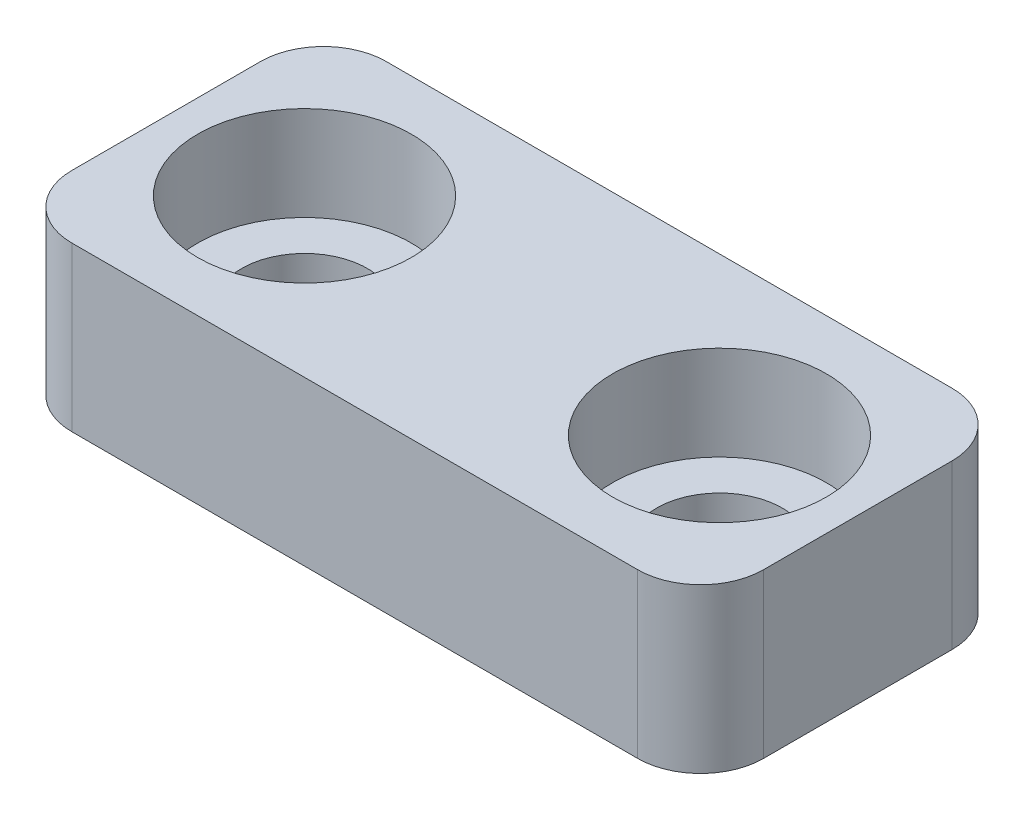
ISO-10303-21;
HEADER;
FILE_DESCRIPTION(('STEP AP214'),'2;1');
FILE_NAME('part.step','',(''),(''),'','','');
FILE_SCHEMA(('AUTOMOTIVE_DESIGN { 1 0 10303 214 1 1 1 1 }'));
ENDSEC;
DATA;
#1=APPLICATION_CONTEXT('core data for automotive mechanical design processes');
#2=APPLICATION_PROTOCOL_DEFINITION('international standard','automotive_design',2000,#1);
#3=PRODUCT_CONTEXT('',#1,'mechanical');
#4=PRODUCT('Part','Part','',(#3));
#5=PRODUCT_RELATED_PRODUCT_CATEGORY('part','',(#4));
#6=PRODUCT_DEFINITION_FORMATION('','',#4);
#7=PRODUCT_DEFINITION_CONTEXT('part definition',#1,'design');
#8=PRODUCT_DEFINITION('design','',#6,#7);
#9=PRODUCT_DEFINITION_SHAPE('','',#8);
#10=(LENGTH_UNIT() NAMED_UNIT(*) SI_UNIT(.MILLI.,.METRE.));
#11=(NAMED_UNIT(*) PLANE_ANGLE_UNIT() SI_UNIT($,.RADIAN.));
#12=(NAMED_UNIT(*) SI_UNIT($,.STERADIAN.) SOLID_ANGLE_UNIT());
#13=UNCERTAINTY_MEASURE_WITH_UNIT(LENGTH_MEASURE(1.E-05),#10,'distance_accuracy_value','');
#14=(GEOMETRIC_REPRESENTATION_CONTEXT(3) GLOBAL_UNCERTAINTY_ASSIGNED_CONTEXT((#13)) GLOBAL_UNIT_ASSIGNED_CONTEXT((#10,
#11,#12)) REPRESENTATION_CONTEXT('',''));
#15=CARTESIAN_POINT('',(0.,0.,0.));
#16=DIRECTION('',(0.,0.,1.));
#17=DIRECTION('',(1.,0.,0.));
#18=AXIS2_PLACEMENT_3D('',#15,#16,#17);
#19=CARTESIAN_POINT('',(3.30000000000001,2.6,0.));
#20=DIRECTION('',(0.,-1.,0.));
#21=DIRECTION('',(0.,0.,-1.));
#22=AXIS2_PLACEMENT_3D('',#19,#20,#21);
#23=CYLINDRICAL_SURFACE('',#22,0.999999999999999);
#24=CARTESIAN_POINT('',(3.30000000000001,0.,0.));
#25=DIRECTION('',(0.,1.,0.));
#26=DIRECTION('',(0.,0.,1.));
#27=AXIS2_PLACEMENT_3D('',#24,#25,#26);
#28=CIRCLE('',#27,0.999999999999999);
#29=CARTESIAN_POINT('',(3.30000000000001,0.,0.999999999999999));
#30=VERTEX_POINT('',#29);
#31=EDGE_CURVE('E135',#30,#30,#28,.T.);
#32=ORIENTED_EDGE('',*,*,#31,.F.);
#33=EDGE_LOOP('',(#32));
#34=FACE_BOUND('',#33,.T.);
#35=CARTESIAN_POINT('',(3.30000000000001,1.1,0.));
#36=DIRECTION('',(0.,1.,0.));
#37=DIRECTION('',(0.,0.,1.));
#38=AXIS2_PLACEMENT_3D('',#35,#36,#37);
#39=CIRCLE('',#38,0.999999999999999);
#40=CARTESIAN_POINT('',(3.30000000000001,1.1,0.999999999999999));
#41=VERTEX_POINT('',#40);
#42=EDGE_CURVE('E148',#41,#41,#39,.T.);
#43=ORIENTED_EDGE('',*,*,#42,.T.);
#44=EDGE_LOOP('',(#43));
#45=FACE_BOUND('',#44,.T.);
#46=ADVANCED_FACE('F35',(#34,#45),#23,.F.);
#47=CARTESIAN_POINT('',(-3.29999999999999,2.6,0.));
#48=DIRECTION('',(0.,-1.,0.));
#49=DIRECTION('',(0.,0.,-1.));
#50=AXIS2_PLACEMENT_3D('',#47,#48,#49);
#51=CYLINDRICAL_SURFACE('',#50,1.);
#52=CARTESIAN_POINT('',(-3.29999999999999,0.,0.));
#53=DIRECTION('',(0.,1.,0.));
#54=DIRECTION('',(0.,0.,1.));
#55=AXIS2_PLACEMENT_3D('',#52,#53,#54);
#56=CIRCLE('',#55,1.);
#57=CARTESIAN_POINT('',(-3.29999999999999,0.,1.));
#58=VERTEX_POINT('',#57);
#59=EDGE_CURVE('E129',#58,#58,#56,.T.);
#60=ORIENTED_EDGE('',*,*,#59,.F.);
#61=EDGE_LOOP('',(#60));
#62=FACE_BOUND('',#61,.T.);
#63=CARTESIAN_POINT('',(-3.29999999999999,1.1,0.));
#64=DIRECTION('',(0.,1.,0.));
#65=DIRECTION('',(0.,0.,1.));
#66=AXIS2_PLACEMENT_3D('',#63,#64,#65);
#67=CIRCLE('',#66,1.);
#68=CARTESIAN_POINT('',(-3.29999999999999,1.1,1.));
#69=VERTEX_POINT('',#68);
#70=EDGE_CURVE('E144',#69,#69,#67,.T.);
#71=ORIENTED_EDGE('',*,*,#70,.T.);
#72=EDGE_LOOP('',(#71));
#73=FACE_BOUND('',#72,.T.);
#74=ADVANCED_FACE('F215',(#62,#73),#51,.F.);
#75=CARTESIAN_POINT('',(0.,2.6,0.));
#76=DIRECTION('',(0.,-1.,0.));
#77=DIRECTION('',(0.,0.,-1.));
#78=AXIS2_PLACEMENT_3D('',#75,#76,#77);
#79=PLANE('',#78);
#80=CARTESIAN_POINT('',(3.30000000000001,2.6,0.));
#81=DIRECTION('',(0.,1.,0.));
#82=DIRECTION('',(0.,0.,1.));
#83=AXIS2_PLACEMENT_3D('',#80,#81,#82);
#84=CIRCLE('',#83,1.7);
#85=CARTESIAN_POINT('',(3.30000000000001,2.6,1.7));
#86=VERTEX_POINT('',#85);
#87=EDGE_CURVE('E197',#86,#86,#84,.T.);
#88=ORIENTED_EDGE('',*,*,#87,.F.);
#89=EDGE_LOOP('',(#88));
#90=FACE_BOUND('',#89,.T.);
#91=CARTESIAN_POINT('',(-3.29999999999999,2.6,0.));
#92=DIRECTION('',(0.,1.,0.));
#93=DIRECTION('',(0.,0.,1.));
#94=AXIS2_PLACEMENT_3D('',#91,#92,#93);
#95=CIRCLE('',#94,1.7);
#96=CARTESIAN_POINT('',(-3.29999999999999,2.6,1.7));
#97=VERTEX_POINT('',#96);
#98=EDGE_CURVE('E151',#97,#97,#95,.T.);
#99=ORIENTED_EDGE('',*,*,#98,.F.);
#100=EDGE_LOOP('',(#99));
#101=FACE_BOUND('',#100,.T.);
#102=DIRECTION('',(1.,0.,0.));
#103=VECTOR('',#102,1.);
#104=CARTESIAN_POINT('',(-5.49999999999999,2.6,2.50000000000001));
#105=LINE('',#104,#103);
#106=CARTESIAN_POINT('',(-4.49999999999999,2.6,2.50000000000001));
#107=VERTEX_POINT('',#106);
#108=CARTESIAN_POINT('',(4.50000000000001,2.6,2.50000000000001));
#109=VERTEX_POINT('',#108);
#110=EDGE_CURVE('E138',#107,#109,#105,.T.);
#111=ORIENTED_EDGE('',*,*,#110,.T.);
#112=CARTESIAN_POINT('',(4.50000000000001,2.6,1.50000000000001));
#113=DIRECTION('',(0.,-1.,0.));
#114=DIRECTION('',(0.,0.,-1.));
#115=AXIS2_PLACEMENT_3D('',#112,#113,#114);
#116=CIRCLE('',#115,1.);
#117=CARTESIAN_POINT('',(5.50000000000001,2.6,1.50000000000001));
#118=VERTEX_POINT('',#117);
#119=EDGE_CURVE('E166',#109,#118,#116,.F.);
#120=ORIENTED_EDGE('',*,*,#119,.T.);
#121=DIRECTION('',(0.,0.,-1.));
#122=VECTOR('',#121,1.);
#123=CARTESIAN_POINT('',(5.50000000000001,2.6,2.50000000000001));
#124=LINE('',#123,#122);
#125=CARTESIAN_POINT('',(5.50000000000001,2.6,-1.5));
#126=VERTEX_POINT('',#125);
#127=EDGE_CURVE('E121',#118,#126,#124,.T.);
#128=ORIENTED_EDGE('',*,*,#127,.T.);
#129=CARTESIAN_POINT('',(4.50000000000001,2.6,-1.5));
#130=DIRECTION('',(0.,-1.,0.));
#131=DIRECTION('',(0.,0.,-1.));
#132=AXIS2_PLACEMENT_3D('',#129,#130,#131);
#133=CIRCLE('',#132,1.);
#134=CARTESIAN_POINT('',(4.50000000000001,2.6,-2.5));
#135=VERTEX_POINT('',#134);
#136=EDGE_CURVE('E164',#126,#135,#133,.F.);
#137=ORIENTED_EDGE('',*,*,#136,.T.);
#138=DIRECTION('',(-1.,0.,0.));
#139=VECTOR('',#138,1.);
#140=CARTESIAN_POINT('',(-5.49999999999999,2.6,-2.5));
#141=LINE('',#140,#139);
#142=CARTESIAN_POINT('',(-4.49999999999999,2.6,-2.5));
#143=VERTEX_POINT('',#142);
#144=EDGE_CURVE('E177',#135,#143,#141,.T.);
#145=ORIENTED_EDGE('',*,*,#144,.T.);
#146=CARTESIAN_POINT('',(-4.49999999999999,2.6,-1.5));
#147=DIRECTION('',(0.,-1.,0.));
#148=DIRECTION('',(0.,0.,-1.));
#149=AXIS2_PLACEMENT_3D('',#146,#147,#148);
#150=CIRCLE('',#149,1.);
#151=CARTESIAN_POINT('',(-5.49999999999999,2.6,-1.5));
#152=VERTEX_POINT('',#151);
#153=EDGE_CURVE('E56',#143,#152,#150,.F.);
#154=ORIENTED_EDGE('',*,*,#153,.T.);
#155=DIRECTION('',(0.,0.,1.));
#156=VECTOR('',#155,1.);
#157=CARTESIAN_POINT('',(-5.49999999999999,2.6,2.50000000000001));
#158=LINE('',#157,#156);
#159=CARTESIAN_POINT('',(-5.49999999999999,2.6,1.50000000000001));
#160=VERTEX_POINT('',#159);
#161=EDGE_CURVE('E185',#152,#160,#158,.T.);
#162=ORIENTED_EDGE('',*,*,#161,.T.);
#163=CARTESIAN_POINT('',(-4.49999999999999,2.6,1.50000000000001));
#164=DIRECTION('',(0.,-1.,0.));
#165=DIRECTION('',(0.,0.,-1.));
#166=AXIS2_PLACEMENT_3D('',#163,#164,#165);
#167=CIRCLE('',#166,1.);
#168=EDGE_CURVE('E161',#160,#107,#167,.F.);
#169=ORIENTED_EDGE('',*,*,#168,.T.);
#170=EDGE_LOOP('',(#111,#120,#128,#137,#145,#154,#162,#169));
#171=FACE_BOUND('',#170,.T.);
#172=ADVANCED_FACE('F212',(#90,#101,#171),#79,.F.);
#173=CARTESIAN_POINT('',(0.,0.,0.));
#174=DIRECTION('',(0.,-1.,0.));
#175=DIRECTION('',(0.,0.,-1.));
#176=AXIS2_PLACEMENT_3D('',#173,#174,#175);
#177=PLANE('',#176);
#178=ORIENTED_EDGE('',*,*,#59,.T.);
#179=EDGE_LOOP('',(#178));
#180=FACE_BOUND('',#179,.T.);
#181=DIRECTION('',(0.,0.,-1.));
#182=VECTOR('',#181,1.);
#183=CARTESIAN_POINT('',(5.50000000000001,0.,2.50000000000001));
#184=LINE('',#183,#182);
#185=CARTESIAN_POINT('',(5.50000000000001,0.,1.50000000000001));
#186=VERTEX_POINT('',#185);
#187=CARTESIAN_POINT('',(5.50000000000001,0.,-1.5));
#188=VERTEX_POINT('',#187);
#189=EDGE_CURVE('E118',#186,#188,#184,.T.);
#190=ORIENTED_EDGE('',*,*,#189,.F.);
#191=CARTESIAN_POINT('',(4.50000000000001,0.,1.50000000000001));
#192=DIRECTION('',(0.,-1.,0.));
#193=DIRECTION('',(0.,0.,-1.));
#194=AXIS2_PLACEMENT_3D('',#191,#192,#193);
#195=CIRCLE('',#194,1.);
#196=CARTESIAN_POINT('',(4.50000000000001,0.,2.50000000000001));
#197=VERTEX_POINT('',#196);
#198=EDGE_CURVE('E101',#186,#197,#195,.T.);
#199=ORIENTED_EDGE('',*,*,#198,.T.);
#200=DIRECTION('',(1.,0.,0.));
#201=VECTOR('',#200,1.);
#202=CARTESIAN_POINT('',(-5.49999999999999,0.,2.50000000000001));
#203=LINE('',#202,#201);
#204=CARTESIAN_POINT('',(-4.49999999999999,0.,2.50000000000001));
#205=VERTEX_POINT('',#204);
#206=EDGE_CURVE('E142',#205,#197,#203,.T.);
#207=ORIENTED_EDGE('',*,*,#206,.F.);
#208=CARTESIAN_POINT('',(-4.49999999999999,0.,1.50000000000001));
#209=DIRECTION('',(0.,-1.,0.));
#210=DIRECTION('',(0.,0.,-1.));
#211=AXIS2_PLACEMENT_3D('',#208,#209,#210);
#212=CIRCLE('',#211,1.);
#213=CARTESIAN_POINT('',(-5.49999999999999,0.,1.50000000000001));
#214=VERTEX_POINT('',#213);
#215=EDGE_CURVE('E122',#205,#214,#212,.T.);
#216=ORIENTED_EDGE('',*,*,#215,.T.);
#217=DIRECTION('',(0.,0.,1.));
#218=VECTOR('',#217,1.);
#219=CARTESIAN_POINT('',(-5.49999999999999,0.,2.50000000000001));
#220=LINE('',#219,#218);
#221=CARTESIAN_POINT('',(-5.49999999999999,0.,-1.5));
#222=VERTEX_POINT('',#221);
#223=EDGE_CURVE('E132',#222,#214,#220,.T.);
#224=ORIENTED_EDGE('',*,*,#223,.F.);
#225=CARTESIAN_POINT('',(-4.49999999999999,0.,-1.5));
#226=DIRECTION('',(0.,-1.,0.));
#227=DIRECTION('',(0.,0.,-1.));
#228=AXIS2_PLACEMENT_3D('',#225,#226,#227);
#229=CIRCLE('',#228,1.);
#230=CARTESIAN_POINT('',(-4.49999999999999,0.,-2.5));
#231=VERTEX_POINT('',#230);
#232=EDGE_CURVE('E155',#222,#231,#229,.T.);
#233=ORIENTED_EDGE('',*,*,#232,.T.);
#234=DIRECTION('',(-1.,0.,0.));
#235=VECTOR('',#234,1.);
#236=CARTESIAN_POINT('',(-5.49999999999999,0.,-2.5));
#237=LINE('',#236,#235);
#238=CARTESIAN_POINT('',(4.50000000000001,0.,-2.5));
#239=VERTEX_POINT('',#238);
#240=EDGE_CURVE('E128',#239,#231,#237,.T.);
#241=ORIENTED_EDGE('',*,*,#240,.F.);
#242=CARTESIAN_POINT('',(4.50000000000001,0.,-1.5));
#243=DIRECTION('',(0.,-1.,0.));
#244=DIRECTION('',(0.,0.,-1.));
#245=AXIS2_PLACEMENT_3D('',#242,#243,#244);
#246=CIRCLE('',#245,1.);
#247=EDGE_CURVE('E112',#239,#188,#246,.T.);
#248=ORIENTED_EDGE('',*,*,#247,.T.);
#249=EDGE_LOOP('',(#190,#199,#207,#216,#224,#233,#241,#248));
#250=FACE_BOUND('',#249,.T.);
#251=ORIENTED_EDGE('',*,*,#31,.T.);
#252=EDGE_LOOP('',(#251));
#253=FACE_BOUND('',#252,.T.);
#254=ADVANCED_FACE('F125',(#180,#250,#253),#177,.T.);
#255=CARTESIAN_POINT('',(5.50000000000001,2.6,2.50000000000001));
#256=DIRECTION('',(-1.,0.,0.));
#257=DIRECTION('',(0.,0.,1.));
#258=AXIS2_PLACEMENT_3D('',#255,#256,#257);
#259=PLANE('',#258);
#260=ORIENTED_EDGE('',*,*,#127,.F.);
#261=DIRECTION('',(0.,-1.,0.));
#262=VECTOR('',#261,1.);
#263=CARTESIAN_POINT('',(5.50000000000001,2.6,1.50000000000001));
#264=LINE('',#263,#262);
#265=EDGE_CURVE('E105',#118,#186,#264,.T.);
#266=ORIENTED_EDGE('',*,*,#265,.T.);
#267=ORIENTED_EDGE('',*,*,#189,.T.);
#268=DIRECTION('',(0.,-1.,0.));
#269=VECTOR('',#268,1.);
#270=CARTESIAN_POINT('',(5.50000000000001,2.6,-1.5));
#271=LINE('',#270,#269);
#272=EDGE_CURVE('E123',#188,#126,#271,.F.);
#273=ORIENTED_EDGE('',*,*,#272,.T.);
#274=EDGE_LOOP('',(#260,#266,#267,#273));
#275=FACE_BOUND('',#274,.T.);
#276=ADVANCED_FACE('F117',(#275),#259,.F.);
#277=CARTESIAN_POINT('',(-5.49999999999999,2.6,-2.5));
#278=DIRECTION('',(0.,0.,1.));
#279=DIRECTION('',(1.,0.,0.));
#280=AXIS2_PLACEMENT_3D('',#277,#278,#279);
#281=PLANE('',#280);
#282=ORIENTED_EDGE('',*,*,#144,.F.);
#283=DIRECTION('',(0.,-1.,0.));
#284=VECTOR('',#283,1.);
#285=CARTESIAN_POINT('',(4.50000000000001,2.6,-2.5));
#286=LINE('',#285,#284);
#287=EDGE_CURVE('E170',#135,#239,#286,.T.);
#288=ORIENTED_EDGE('',*,*,#287,.T.);
#289=ORIENTED_EDGE('',*,*,#240,.T.);
#290=DIRECTION('',(0.,-1.,0.));
#291=VECTOR('',#290,1.);
#292=CARTESIAN_POINT('',(-4.49999999999999,2.6,-2.5));
#293=LINE('',#292,#291);
#294=EDGE_CURVE('E168',#231,#143,#293,.F.);
#295=ORIENTED_EDGE('',*,*,#294,.T.);
#296=EDGE_LOOP('',(#282,#288,#289,#295));
#297=FACE_BOUND('',#296,.T.);
#298=ADVANCED_FACE('F175',(#297),#281,.F.);
#299=CARTESIAN_POINT('',(-5.49999999999999,2.6,2.50000000000001));
#300=DIRECTION('',(1.,0.,0.));
#301=DIRECTION('',(0.,0.,-1.));
#302=AXIS2_PLACEMENT_3D('',#299,#300,#301);
#303=PLANE('',#302);
#304=ORIENTED_EDGE('',*,*,#161,.F.);
#305=DIRECTION('',(0.,-1.,0.));
#306=VECTOR('',#305,1.);
#307=CARTESIAN_POINT('',(-5.49999999999999,2.6,-1.5));
#308=LINE('',#307,#306);
#309=EDGE_CURVE('E11',#152,#222,#308,.T.);
#310=ORIENTED_EDGE('',*,*,#309,.T.);
#311=ORIENTED_EDGE('',*,*,#223,.T.);
#312=DIRECTION('',(0.,-1.,0.));
#313=VECTOR('',#312,1.);
#314=CARTESIAN_POINT('',(-5.49999999999999,2.6,1.50000000000001));
#315=LINE('',#314,#313);
#316=EDGE_CURVE('E43',#214,#160,#315,.F.);
#317=ORIENTED_EDGE('',*,*,#316,.T.);
#318=EDGE_LOOP('',(#304,#310,#311,#317));
#319=FACE_BOUND('',#318,.T.);
#320=ADVANCED_FACE('F184',(#319),#303,.F.);
#321=CARTESIAN_POINT('',(-5.49999999999999,2.6,2.50000000000001));
#322=DIRECTION('',(0.,0.,-1.));
#323=DIRECTION('',(-1.,0.,0.));
#324=AXIS2_PLACEMENT_3D('',#321,#322,#323);
#325=PLANE('',#324);
#326=ORIENTED_EDGE('',*,*,#206,.T.);
#327=DIRECTION('',(0.,-1.,0.));
#328=VECTOR('',#327,1.);
#329=CARTESIAN_POINT('',(4.50000000000001,2.6,2.50000000000001));
#330=LINE('',#329,#328);
#331=EDGE_CURVE('E106',#197,#109,#330,.F.);
#332=ORIENTED_EDGE('',*,*,#331,.T.);
#333=ORIENTED_EDGE('',*,*,#110,.F.);
#334=DIRECTION('',(0.,-1.,0.));
#335=VECTOR('',#334,1.);
#336=CARTESIAN_POINT('',(-4.49999999999999,2.6,2.50000000000001));
#337=LINE('',#336,#335);
#338=EDGE_CURVE('E111',#107,#205,#337,.T.);
#339=ORIENTED_EDGE('',*,*,#338,.T.);
#340=EDGE_LOOP('',(#326,#332,#333,#339));
#341=FACE_BOUND('',#340,.T.);
#342=ADVANCED_FACE('F221',(#341),#325,.F.);
#343=CARTESIAN_POINT('',(-3.29999999999999,1.1,0.));
#344=DIRECTION('',(0.,1.,0.));
#345=DIRECTION('',(0.,0.,1.));
#346=AXIS2_PLACEMENT_3D('',#343,#344,#345);
#347=CYLINDRICAL_SURFACE('',#346,1.7);
#348=CARTESIAN_POINT('',(-3.29999999999999,1.1,0.));
#349=DIRECTION('',(0.,1.,0.));
#350=DIRECTION('',(0.,0.,1.));
#351=AXIS2_PLACEMENT_3D('',#348,#349,#350);
#352=CIRCLE('',#351,1.7);
#353=CARTESIAN_POINT('',(-3.29999999999999,1.1,1.7));
#354=VERTEX_POINT('',#353);
#355=EDGE_CURVE('E147',#354,#354,#352,.T.);
#356=ORIENTED_EDGE('',*,*,#355,.F.);
#357=EDGE_LOOP('',(#356));
#358=FACE_BOUND('',#357,.T.);
#359=ORIENTED_EDGE('',*,*,#98,.T.);
#360=EDGE_LOOP('',(#359));
#361=FACE_BOUND('',#360,.T.);
#362=ADVANCED_FACE('F239',(#358,#361),#347,.F.);
#363=CARTESIAN_POINT('',(-3.29999999999999,1.1,0.));
#364=DIRECTION('',(0.,1.,0.));
#365=DIRECTION('',(0.,0.,1.));
#366=AXIS2_PLACEMENT_3D('',#363,#364,#365);
#367=PLANE('',#366);
#368=ORIENTED_EDGE('',*,*,#70,.F.);
#369=EDGE_LOOP('',(#368));
#370=FACE_BOUND('',#369,.T.);
#371=ORIENTED_EDGE('',*,*,#355,.T.);
#372=EDGE_LOOP('',(#371));
#373=FACE_BOUND('',#372,.T.);
#374=ADVANCED_FACE('F208',(#370,#373),#367,.T.);
#375=CARTESIAN_POINT('',(3.30000000000001,1.1,0.));
#376=DIRECTION('',(0.,1.,0.));
#377=DIRECTION('',(0.,0.,1.));
#378=AXIS2_PLACEMENT_3D('',#375,#376,#377);
#379=CYLINDRICAL_SURFACE('',#378,1.7);
#380=CARTESIAN_POINT('',(3.30000000000001,1.1,0.));
#381=DIRECTION('',(0.,1.,0.));
#382=DIRECTION('',(0.,0.,1.));
#383=AXIS2_PLACEMENT_3D('',#380,#381,#382);
#384=CIRCLE('',#383,1.7);
#385=CARTESIAN_POINT('',(3.30000000000001,1.1,1.7));
#386=VERTEX_POINT('',#385);
#387=EDGE_CURVE('E152',#386,#386,#384,.T.);
#388=ORIENTED_EDGE('',*,*,#387,.F.);
#389=EDGE_LOOP('',(#388));
#390=FACE_BOUND('',#389,.T.);
#391=ORIENTED_EDGE('',*,*,#87,.T.);
#392=EDGE_LOOP('',(#391));
#393=FACE_BOUND('',#392,.T.);
#394=ADVANCED_FACE('F205',(#390,#393),#379,.F.);
#395=CARTESIAN_POINT('',(3.30000000000001,1.1,0.));
#396=DIRECTION('',(0.,1.,0.));
#397=DIRECTION('',(0.,0.,1.));
#398=AXIS2_PLACEMENT_3D('',#395,#396,#397);
#399=PLANE('',#398);
#400=ORIENTED_EDGE('',*,*,#42,.F.);
#401=EDGE_LOOP('',(#400));
#402=FACE_BOUND('',#401,.T.);
#403=ORIENTED_EDGE('',*,*,#387,.T.);
#404=EDGE_LOOP('',(#403));
#405=FACE_BOUND('',#404,.T.);
#406=ADVANCED_FACE('F203',(#402,#405),#399,.T.);
#407=CARTESIAN_POINT('',(4.50000000000001,2.6,1.50000000000001));
#408=DIRECTION('',(0.,-1.,0.));
#409=DIRECTION('',(0.,0.,-1.));
#410=AXIS2_PLACEMENT_3D('',#407,#408,#409);
#411=CYLINDRICAL_SURFACE('',#410,1.);
#412=ORIENTED_EDGE('',*,*,#119,.F.);
#413=ORIENTED_EDGE('',*,*,#331,.F.);
#414=ORIENTED_EDGE('',*,*,#198,.F.);
#415=ORIENTED_EDGE('',*,*,#265,.F.);
#416=EDGE_LOOP('',(#412,#413,#414,#415));
#417=FACE_BOUND('',#416,.T.);
#418=ADVANCED_FACE('F104',(#417),#411,.T.);
#419=CARTESIAN_POINT('',(4.50000000000001,2.6,-1.5));
#420=DIRECTION('',(0.,-1.,0.));
#421=DIRECTION('',(0.,0.,-1.));
#422=AXIS2_PLACEMENT_3D('',#419,#420,#421);
#423=CYLINDRICAL_SURFACE('',#422,1.);
#424=ORIENTED_EDGE('',*,*,#136,.F.);
#425=ORIENTED_EDGE('',*,*,#272,.F.);
#426=ORIENTED_EDGE('',*,*,#247,.F.);
#427=ORIENTED_EDGE('',*,*,#287,.F.);
#428=EDGE_LOOP('',(#424,#425,#426,#427));
#429=FACE_BOUND('',#428,.T.);
#430=ADVANCED_FACE('F227',(#429),#423,.T.);
#431=CARTESIAN_POINT('',(-4.49999999999999,2.6,-1.5));
#432=DIRECTION('',(0.,-1.,0.));
#433=DIRECTION('',(0.,0.,-1.));
#434=AXIS2_PLACEMENT_3D('',#431,#432,#433);
#435=CYLINDRICAL_SURFACE('',#434,1.);
#436=ORIENTED_EDGE('',*,*,#153,.F.);
#437=ORIENTED_EDGE('',*,*,#294,.F.);
#438=ORIENTED_EDGE('',*,*,#232,.F.);
#439=ORIENTED_EDGE('',*,*,#309,.F.);
#440=EDGE_LOOP('',(#436,#437,#438,#439));
#441=FACE_BOUND('',#440,.T.);
#442=ADVANCED_FACE('F183',(#441),#435,.T.);
#443=CARTESIAN_POINT('',(-4.49999999999999,2.6,1.50000000000001));
#444=DIRECTION('',(0.,-1.,0.));
#445=DIRECTION('',(0.,0.,-1.));
#446=AXIS2_PLACEMENT_3D('',#443,#444,#445);
#447=CYLINDRICAL_SURFACE('',#446,1.);
#448=ORIENTED_EDGE('',*,*,#168,.F.);
#449=ORIENTED_EDGE('',*,*,#316,.F.);
#450=ORIENTED_EDGE('',*,*,#215,.F.);
#451=ORIENTED_EDGE('',*,*,#338,.F.);
#452=EDGE_LOOP('',(#448,#449,#450,#451));
#453=FACE_BOUND('',#452,.T.);
#454=ADVANCED_FACE('F37',(#453),#447,.T.);
#455=CLOSED_SHELL('',(#46,#74,#172,#254,#276,#298,#320,#342,#362,#374,#394,#406,#418,#430,#442,#454));
#456=MANIFOLD_SOLID_BREP('B2',#455);
#457=ADVANCED_BREP_SHAPE_REPRESENTATION('',(#18,#456),#14);
#458=SHAPE_DEFINITION_REPRESENTATION(#9,#457);
ENDSEC;
END-ISO-10303-21;
